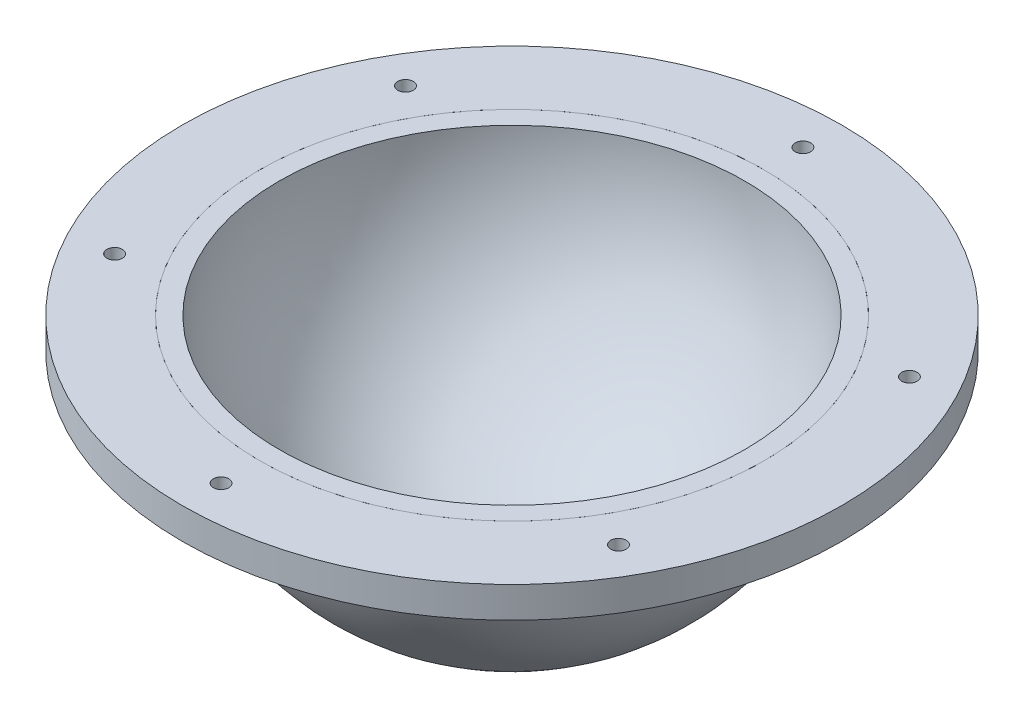
ISO-10303-21;
HEADER;
FILE_DESCRIPTION(('STEP AP214'),'2;1');
FILE_NAME('part.step','',(''),(''),'','','');
FILE_SCHEMA(('AUTOMOTIVE_DESIGN { 1 0 10303 214 1 1 1 1 }'));
ENDSEC;
DATA;
#1=APPLICATION_CONTEXT('core data for automotive mechanical design processes');
#2=APPLICATION_PROTOCOL_DEFINITION('international standard','automotive_design',2000,#1);
#3=PRODUCT_CONTEXT('',#1,'mechanical');
#4=PRODUCT('Part','Part','',(#3));
#5=PRODUCT_RELATED_PRODUCT_CATEGORY('part','',(#4));
#6=PRODUCT_DEFINITION_FORMATION('','',#4);
#7=PRODUCT_DEFINITION_CONTEXT('part definition',#1,'design');
#8=PRODUCT_DEFINITION('design','',#6,#7);
#9=PRODUCT_DEFINITION_SHAPE('','',#8);
#10=(LENGTH_UNIT() NAMED_UNIT(*) SI_UNIT(.MILLI.,.METRE.));
#11=(NAMED_UNIT(*) PLANE_ANGLE_UNIT() SI_UNIT($,.RADIAN.));
#12=(NAMED_UNIT(*) SI_UNIT($,.STERADIAN.) SOLID_ANGLE_UNIT());
#13=UNCERTAINTY_MEASURE_WITH_UNIT(LENGTH_MEASURE(1.E-05),#10,'distance_accuracy_value','');
#14=(GEOMETRIC_REPRESENTATION_CONTEXT(3) GLOBAL_UNCERTAINTY_ASSIGNED_CONTEXT((#13)) GLOBAL_UNIT_ASSIGNED_CONTEXT((#10,
#11,#12)) REPRESENTATION_CONTEXT('',''));
#15=CARTESIAN_POINT('',(0.,0.,0.));
#16=DIRECTION('',(0.,0.,1.));
#17=DIRECTION('',(1.,0.,0.));
#18=AXIS2_PLACEMENT_3D('',#15,#16,#17);
#19=CARTESIAN_POINT('',(0.,-8.,0.));
#20=DIRECTION('',(0.,1.,0.));
#21=DIRECTION('',(-1.,0.,0.));
#22=AXIS2_PLACEMENT_3D('',#19,#20,#21);
#23=CYLINDRICAL_SURFACE('',#22,85.);
#24=CARTESIAN_POINT('',(0.,-8.,0.));
#25=DIRECTION('',(0.,1.,0.));
#26=DIRECTION('',(-1.,0.,0.));
#27=AXIS2_PLACEMENT_3D('',#24,#25,#26);
#28=CIRCLE('',#27,85.);
#29=CARTESIAN_POINT('',(-85.0000000000001,-7.99999999999941,0.));
#30=VERTEX_POINT('',#29);
#31=EDGE_CURVE('E11',#30,#30,#28,.T.);
#32=ORIENTED_EDGE('',*,*,#31,.T.);
#33=EDGE_LOOP('',(#32));
#34=FACE_BOUND('',#33,.T.);
#35=CARTESIAN_POINT('',(0.,0.,0.));
#36=DIRECTION('',(0.,1.,0.));
#37=DIRECTION('',(-1.,0.,0.));
#38=AXIS2_PLACEMENT_3D('',#35,#36,#37);
#39=CIRCLE('',#38,85.);
#40=CARTESIAN_POINT('',(-85.,5.93551827603333E-13,0.));
#41=VERTEX_POINT('',#40);
#42=EDGE_CURVE('E48',#41,#41,#39,.T.);
#43=ORIENTED_EDGE('',*,*,#42,.F.);
#44=EDGE_LOOP('',(#43));
#45=FACE_BOUND('',#44,.T.);
#46=ADVANCED_FACE('F45',(#34,#45),#23,.T.);
#47=CARTESIAN_POINT('',(0.,-8.,0.));
#48=DIRECTION('',(0.,1.,0.));
#49=DIRECTION('',(-1.,0.,0.));
#50=AXIS2_PLACEMENT_3D('',#47,#48,#49);
#51=PLANE('',#50);
#52=CARTESIAN_POINT('',(-64.9519052838282,-7.99999999999955,37.5000000000028));
#53=DIRECTION('',(0.,1.,0.));
#54=DIRECTION('',(-1.,0.,0.));
#55=AXIS2_PLACEMENT_3D('',#52,#53,#54);
#56=CIRCLE('',#55,2.00000000000607);
#57=CARTESIAN_POINT('',(-66.9519052838343,-7.99999999999954,37.5000000000028));
#58=VERTEX_POINT('',#57);
#59=EDGE_CURVE('E60',#58,#58,#56,.T.);
#60=ORIENTED_EDGE('',*,*,#59,.T.);
#61=EDGE_LOOP('',(#60));
#62=FACE_BOUND('',#61,.T.);
#63=CARTESIAN_POINT('',(6.32187586523135E-12,-8.,75.));
#64=DIRECTION('',(0.,1.,0.));
#65=DIRECTION('',(-1.,0.,0.));
#66=AXIS2_PLACEMENT_3D('',#63,#64,#65);
#67=CIRCLE('',#66,2.0000000000066);
#68=CARTESIAN_POINT('',(-2.00000000000028,-7.99999999999999,75.));
#69=VERTEX_POINT('',#68);
#70=EDGE_CURVE('E65',#69,#69,#67,.T.);
#71=ORIENTED_EDGE('',*,*,#70,.T.);
#72=EDGE_LOOP('',(#71));
#73=FACE_BOUND('',#72,.T.);
#74=CARTESIAN_POINT('',(64.9519052838377,-8.00000000000045,37.4999999999973));
#75=DIRECTION('',(0.,1.,0.));
#76=DIRECTION('',(-1.,0.,0.));
#77=AXIS2_PLACEMENT_3D('',#74,#75,#76);
#78=CIRCLE('',#77,2.00000000000411);
#79=CARTESIAN_POINT('',(62.9519052838336,-8.00000000000044,37.4999999999973));
#80=VERTEX_POINT('',#79);
#81=EDGE_CURVE('E68',#80,#80,#78,.T.);
#82=ORIENTED_EDGE('',*,*,#81,.T.);
#83=EDGE_LOOP('',(#82));
#84=FACE_BOUND('',#83,.T.);
#85=CARTESIAN_POINT('',(64.9519052838345,-8.00000000000045,-37.5000000000028));
#86=DIRECTION('',(0.,1.,0.));
#87=DIRECTION('',(-1.,0.,0.));
#88=AXIS2_PLACEMENT_3D('',#85,#86,#87);
#89=CIRCLE('',#88,2.0000000000009);
#90=CARTESIAN_POINT('',(62.9519052838336,-8.00000000000044,-37.5000000000028));
#91=VERTEX_POINT('',#90);
#92=EDGE_CURVE('E71',#91,#91,#89,.T.);
#93=ORIENTED_EDGE('',*,*,#92,.T.);
#94=EDGE_LOOP('',(#93));
#95=FACE_BOUND('',#94,.T.);
#96=CARTESIAN_POINT('',(0.,-8.,-75.));
#97=DIRECTION('',(0.,1.,0.));
#98=DIRECTION('',(-1.,0.,0.));
#99=AXIS2_PLACEMENT_3D('',#96,#97,#98);
#100=CIRCLE('',#99,2.);
#101=CARTESIAN_POINT('',(-2.00000000000006,-7.99999999999999,-75.));
#102=VERTEX_POINT('',#101);
#103=EDGE_CURVE('E74',#102,#102,#100,.T.);
#104=ORIENTED_EDGE('',*,*,#103,.T.);
#105=EDGE_LOOP('',(#104));
#106=FACE_BOUND('',#105,.T.);
#107=CARTESIAN_POINT('',(-64.9519052838314,-7.99999999999955,-37.4999999999972));
#108=DIRECTION('',(0.,1.,0.));
#109=DIRECTION('',(-1.,0.,0.));
#110=AXIS2_PLACEMENT_3D('',#107,#108,#109);
#111=CIRCLE('',#110,2.00000000000322);
#112=CARTESIAN_POINT('',(-66.9519052838346,-7.99999999999954,-37.4999999999972));
#113=VERTEX_POINT('',#112);
#114=EDGE_CURVE('E77',#113,#113,#111,.T.);
#115=ORIENTED_EDGE('',*,*,#114,.T.);
#116=EDGE_LOOP('',(#115));
#117=FACE_BOUND('',#116,.T.);
#118=CARTESIAN_POINT('',(0.,-8.,0.));
#119=DIRECTION('',(0.,1.,0.));
#120=DIRECTION('',(-1.,0.,0.));
#121=AXIS2_PLACEMENT_3D('',#118,#119,#120);
#122=CIRCLE('',#121,65.);
#123=CARTESIAN_POINT('',(-65.0000000000001,-7.99999999999955,0.));
#124=VERTEX_POINT('',#123);
#125=EDGE_CURVE('E55',#124,#124,#122,.T.);
#126=ORIENTED_EDGE('',*,*,#125,.T.);
#127=EDGE_LOOP('',(#126));
#128=FACE_BOUND('',#127,.T.);
#129=ORIENTED_EDGE('',*,*,#31,.F.);
#130=EDGE_LOOP('',(#129));
#131=FACE_BOUND('',#130,.T.);
#132=ADVANCED_FACE('F106',(#62,#73,#84,#95,#106,#117,#128,#131),#51,.F.);
#133=CARTESIAN_POINT('',(0.,0.,0.));
#134=DIRECTION('',(0.,1.,0.));
#135=DIRECTION('',(-1.,0.,0.));
#136=AXIS2_PLACEMENT_3D('',#133,#134,#135);
#137=PLANE('',#136);
#138=CARTESIAN_POINT('',(-64.9519052838281,4.53556730441585E-13,37.5000000000028));
#139=DIRECTION('',(0.,1.,0.));
#140=DIRECTION('',(-1.,0.,0.));
#141=AXIS2_PLACEMENT_3D('',#138,#139,#140);
#142=CIRCLE('',#141,2.00000000000607);
#143=CARTESIAN_POINT('',(-66.9519052838342,4.67522655797E-13,37.5000000000028));
#144=VERTEX_POINT('',#143);
#145=EDGE_CURVE('E80',#144,#144,#142,.T.);
#146=ORIENTED_EDGE('',*,*,#145,.F.);
#147=EDGE_LOOP('',(#146));
#148=FACE_BOUND('',#147,.T.);
#149=CARTESIAN_POINT('',(6.37773956665284E-12,0.,75.));
#150=DIRECTION('',(0.,1.,0.));
#151=DIRECTION('',(-1.,0.,0.));
#152=AXIS2_PLACEMENT_3D('',#149,#150,#151);
#153=CIRCLE('',#152,2.0000000000066);
#154=CARTESIAN_POINT('',(-2.00000000000022,0.,75.));
#155=VERTEX_POINT('',#154);
#156=EDGE_CURVE('E93',#155,#155,#153,.T.);
#157=ORIENTED_EDGE('',*,*,#156,.F.);
#158=EDGE_LOOP('',(#157));
#159=FACE_BOUND('',#158,.T.);
#160=CARTESIAN_POINT('',(64.9519052838377,-4.53556730441652E-13,37.4999999999973));
#161=DIRECTION('',(0.,1.,0.));
#162=DIRECTION('',(-1.,0.,0.));
#163=AXIS2_PLACEMENT_3D('',#160,#161,#162);
#164=CIRCLE('',#163,2.00000000000411);
#165=CARTESIAN_POINT('',(62.9519052838336,-4.39590805086251E-13,37.4999999999973));
#166=VERTEX_POINT('',#165);
#167=EDGE_CURVE('E90',#166,#166,#164,.T.);
#168=ORIENTED_EDGE('',*,*,#167,.F.);
#169=EDGE_LOOP('',(#168));
#170=FACE_BOUND('',#169,.T.);
#171=CARTESIAN_POINT('',(64.9519052838345,-4.5355673044163E-13,-37.5000000000028));
#172=DIRECTION('',(0.,1.,0.));
#173=DIRECTION('',(-1.,0.,0.));
#174=AXIS2_PLACEMENT_3D('',#171,#172,#173);
#175=CIRCLE('',#174,2.0000000000009);
#176=CARTESIAN_POINT('',(62.9519052838336,-4.39590805086251E-13,-37.5000000000028));
#177=VERTEX_POINT('',#176);
#178=EDGE_CURVE('E87',#177,#177,#175,.T.);
#179=ORIENTED_EDGE('',*,*,#178,.F.);
#180=EDGE_LOOP('',(#179));
#181=FACE_BOUND('',#180,.T.);
#182=CARTESIAN_POINT('',(0.,0.,-75.));
#183=DIRECTION('',(0.,1.,0.));
#184=DIRECTION('',(-1.,0.,0.));
#185=AXIS2_PLACEMENT_3D('',#182,#183,#184);
#186=CIRCLE('',#185,2.);
#187=CARTESIAN_POINT('',(-2.,0.,-75.));
#188=VERTEX_POINT('',#187);
#189=EDGE_CURVE('E84',#188,#188,#186,.T.);
#190=ORIENTED_EDGE('',*,*,#189,.F.);
#191=EDGE_LOOP('',(#190));
#192=FACE_BOUND('',#191,.T.);
#193=CARTESIAN_POINT('',(-64.9519052838314,4.53556730441608E-13,-37.4999999999972));
#194=DIRECTION('',(0.,1.,0.));
#195=DIRECTION('',(-1.,0.,0.));
#196=AXIS2_PLACEMENT_3D('',#193,#194,#195);
#197=CIRCLE('',#196,2.00000000000322);
#198=CARTESIAN_POINT('',(-66.9519052838346,4.67522655797003E-13,-37.4999999999972));
#199=VERTEX_POINT('',#198);
#200=EDGE_CURVE('E81',#199,#199,#197,.T.);
#201=ORIENTED_EDGE('',*,*,#200,.F.);
#202=EDGE_LOOP('',(#201));
#203=FACE_BOUND('',#202,.T.);
#204=CARTESIAN_POINT('',(0.,0.,0.));
#205=DIRECTION('',(0.,1.,0.));
#206=DIRECTION('',(-1.,0.,0.));
#207=AXIS2_PLACEMENT_3D('',#204,#205,#206);
#208=CIRCLE('',#207,65.);
#209=CARTESIAN_POINT('',(-65.,4.53892574049607E-13,0.));
#210=VERTEX_POINT('',#209);
#211=EDGE_CURVE('E57',#210,#210,#208,.T.);
#212=ORIENTED_EDGE('',*,*,#211,.F.);
#213=EDGE_LOOP('',(#212));
#214=FACE_BOUND('',#213,.T.);
#215=ORIENTED_EDGE('',*,*,#42,.T.);
#216=EDGE_LOOP('',(#215));
#217=FACE_BOUND('',#216,.T.);
#218=ADVANCED_FACE('F102',(#148,#159,#170,#181,#192,#203,#214,#217),#137,.T.);
#219=CARTESIAN_POINT('',(0.,-8.,0.));
#220=DIRECTION('',(0.,1.,0.));
#221=DIRECTION('',(-1.,0.,0.));
#222=AXIS2_PLACEMENT_3D('',#219,#220,#221);
#223=CYLINDRICAL_SURFACE('',#222,65.);
#224=ORIENTED_EDGE('',*,*,#125,.F.);
#225=EDGE_LOOP('',(#224));
#226=FACE_BOUND('',#225,.T.);
#227=ORIENTED_EDGE('',*,*,#211,.T.);
#228=EDGE_LOOP('',(#227));
#229=FACE_BOUND('',#228,.T.);
#230=ADVANCED_FACE('F105',(#226,#229),#223,.F.);
#231=CARTESIAN_POINT('',(-64.9519052838318,-65.0000000000001,-37.4999999999972));
#232=DIRECTION('',(0.,1.,0.));
#233=DIRECTION('',(-1.,0.,0.));
#234=AXIS2_PLACEMENT_3D('',#231,#232,#233);
#235=CYLINDRICAL_SURFACE('',#234,2.00000000000322);
#236=ORIENTED_EDGE('',*,*,#200,.T.);
#237=EDGE_LOOP('',(#236));
#238=FACE_BOUND('',#237,.T.);
#239=ORIENTED_EDGE('',*,*,#114,.F.);
#240=EDGE_LOOP('',(#239));
#241=FACE_BOUND('',#240,.T.);
#242=ADVANCED_FACE('F133',(#238,#241),#235,.F.);
#243=CARTESIAN_POINT('',(-4.52667927250464E-13,-65.0000000000006,-75.));
#244=DIRECTION('',(0.,1.,0.));
#245=DIRECTION('',(-1.,0.,0.));
#246=AXIS2_PLACEMENT_3D('',#243,#244,#245);
#247=CYLINDRICAL_SURFACE('',#246,2.);
#248=ORIENTED_EDGE('',*,*,#189,.T.);
#249=EDGE_LOOP('',(#248));
#250=FACE_BOUND('',#249,.T.);
#251=ORIENTED_EDGE('',*,*,#103,.F.);
#252=EDGE_LOOP('',(#251));
#253=FACE_BOUND('',#252,.T.);
#254=ADVANCED_FACE('F137',(#250,#253),#247,.F.);
#255=CARTESIAN_POINT('',(64.9519052838341,-65.0000000000011,-37.5000000000028));
#256=DIRECTION('',(0.,1.,0.));
#257=DIRECTION('',(-1.,0.,0.));
#258=AXIS2_PLACEMENT_3D('',#255,#256,#257);
#259=CYLINDRICAL_SURFACE('',#258,2.0000000000009);
#260=ORIENTED_EDGE('',*,*,#178,.T.);
#261=EDGE_LOOP('',(#260));
#262=FACE_BOUND('',#261,.T.);
#263=ORIENTED_EDGE('',*,*,#92,.F.);
#264=EDGE_LOOP('',(#263));
#265=FACE_BOUND('',#264,.T.);
#266=ADVANCED_FACE('F141',(#262,#265),#259,.F.);
#267=CARTESIAN_POINT('',(64.9519052838373,-65.0000000000011,37.4999999999973));
#268=DIRECTION('',(0.,1.,0.));
#269=DIRECTION('',(-1.,0.,0.));
#270=AXIS2_PLACEMENT_3D('',#267,#268,#269);
#271=CYLINDRICAL_SURFACE('',#270,2.00000000000411);
#272=ORIENTED_EDGE('',*,*,#167,.T.);
#273=EDGE_LOOP('',(#272));
#274=FACE_BOUND('',#273,.T.);
#275=ORIENTED_EDGE('',*,*,#81,.F.);
#276=EDGE_LOOP('',(#275));
#277=FACE_BOUND('',#276,.T.);
#278=ADVANCED_FACE('F145',(#274,#277),#271,.F.);
#279=CARTESIAN_POINT('',(5.92384699260323E-12,-65.0000000000006,75.));
#280=DIRECTION('',(0.,1.,0.));
#281=DIRECTION('',(-1.,0.,0.));
#282=AXIS2_PLACEMENT_3D('',#279,#280,#281);
#283=CYLINDRICAL_SURFACE('',#282,2.0000000000066);
#284=ORIENTED_EDGE('',*,*,#156,.T.);
#285=EDGE_LOOP('',(#284));
#286=FACE_BOUND('',#285,.T.);
#287=ORIENTED_EDGE('',*,*,#70,.F.);
#288=EDGE_LOOP('',(#287));
#289=FACE_BOUND('',#288,.T.);
#290=ADVANCED_FACE('F149',(#286,#289),#283,.F.);
#291=CARTESIAN_POINT('',(-64.9519052838286,-65.0000000000001,37.5000000000028));
#292=DIRECTION('',(0.,1.,0.));
#293=DIRECTION('',(-1.,0.,0.));
#294=AXIS2_PLACEMENT_3D('',#291,#292,#293);
#295=CYLINDRICAL_SURFACE('',#294,2.00000000000607);
#296=ORIENTED_EDGE('',*,*,#145,.T.);
#297=EDGE_LOOP('',(#296));
#298=FACE_BOUND('',#297,.T.);
#299=ORIENTED_EDGE('',*,*,#59,.F.);
#300=EDGE_LOOP('',(#299));
#301=FACE_BOUND('',#300,.T.);
#302=ADVANCED_FACE('F99',(#298,#301),#295,.F.);
#303=CLOSED_SHELL('',(#46,#132,#218,#230,#242,#254,#266,#278,#290,#302));
#304=MANIFOLD_SOLID_BREP('B2',#303);
#305=CARTESIAN_POINT('',(0.,0.,0.));
#306=DIRECTION('',(0.,0.,1.));
#307=DIRECTION('',(1.,0.,0.));
#308=AXIS2_PLACEMENT_3D('',#305,#306,#307);
#309=SPHERICAL_SURFACE('',#308,65.);
#310=CARTESIAN_POINT('',(0.,0.,0.));
#311=DIRECTION('',(0.,-1.,0.));
#312=DIRECTION('',(0.,0.,1.));
#313=AXIS2_PLACEMENT_3D('',#310,#311,#312);
#314=SPHERICAL_SURFACE('',#313,65.);
#315=CARTESIAN_POINT('',(0.,0.,0.));
#316=DIRECTION('',(0.,-1.,0.));
#317=DIRECTION('',(0.,0.,1.));
#318=AXIS2_PLACEMENT_3D('',#315,#316,#317);
#319=CIRCLE('',#318,65.);
#320=CARTESIAN_POINT('',(0.,0.,65.));
#321=VERTEX_POINT('',#320);
#322=EDGE_CURVE('E241',#321,#321,#319,.T.);
#323=ORIENTED_EDGE('',*,*,#322,.T.);
#324=EDGE_LOOP('',(#323));
#325=FACE_BOUND('',#324,.T.);
#326=ADVANCED_FACE('F233',(#325),#314,.T.);
#327=CARTESIAN_POINT('',(0.,0.,0.));
#328=DIRECTION('',(0.,0.,1.));
#329=DIRECTION('',(1.,0.,0.));
#330=AXIS2_PLACEMENT_3D('',#327,#328,#329);
#331=SPHERICAL_SURFACE('',#330,60.);
#332=CARTESIAN_POINT('',(0.,0.,0.));
#333=DIRECTION('',(0.,-1.,0.));
#334=DIRECTION('',(-1.,0.,0.));
#335=AXIS2_PLACEMENT_3D('',#332,#333,#334);
#336=SPHERICAL_SURFACE('',#335,60.);
#337=CARTESIAN_POINT('',(0.,0.,0.));
#338=DIRECTION('',(0.,-1.,0.));
#339=DIRECTION('',(-1.,0.,0.));
#340=AXIS2_PLACEMENT_3D('',#337,#338,#339);
#341=CIRCLE('',#340,60.);
#342=CARTESIAN_POINT('',(-60.,4.18977760661176E-13,0.));
#343=VERTEX_POINT('',#342);
#344=EDGE_CURVE('E44',#343,#343,#341,.T.);
#345=ORIENTED_EDGE('',*,*,#344,.F.);
#346=EDGE_LOOP('',(#345));
#347=FACE_BOUND('',#346,.T.);
#348=ADVANCED_FACE('F235',(#347),#336,.F.);
#349=CARTESIAN_POINT('',(0.,0.,0.));
#350=DIRECTION('',(0.,-1.,0.));
#351=DIRECTION('',(-1.,0.,0.));
#352=AXIS2_PLACEMENT_3D('',#349,#350,#351);
#353=PLANE('',#352);
#354=ORIENTED_EDGE('',*,*,#322,.F.);
#355=EDGE_LOOP('',(#354));
#356=FACE_BOUND('',#355,.T.);
#357=ORIENTED_EDGE('',*,*,#344,.T.);
#358=EDGE_LOOP('',(#357));
#359=FACE_BOUND('',#358,.T.);
#360=ADVANCED_FACE('F249',(#356,#359),#353,.F.);
#361=CLOSED_SHELL('',(#326,#348,#360));
#362=MANIFOLD_SOLID_BREP('B6',#361);
#363=ADVANCED_BREP_SHAPE_REPRESENTATION('',(#18,#304,#362),#14);
#364=SHAPE_DEFINITION_REPRESENTATION(#9,#363);
ENDSEC;
END-ISO-10303-21;
